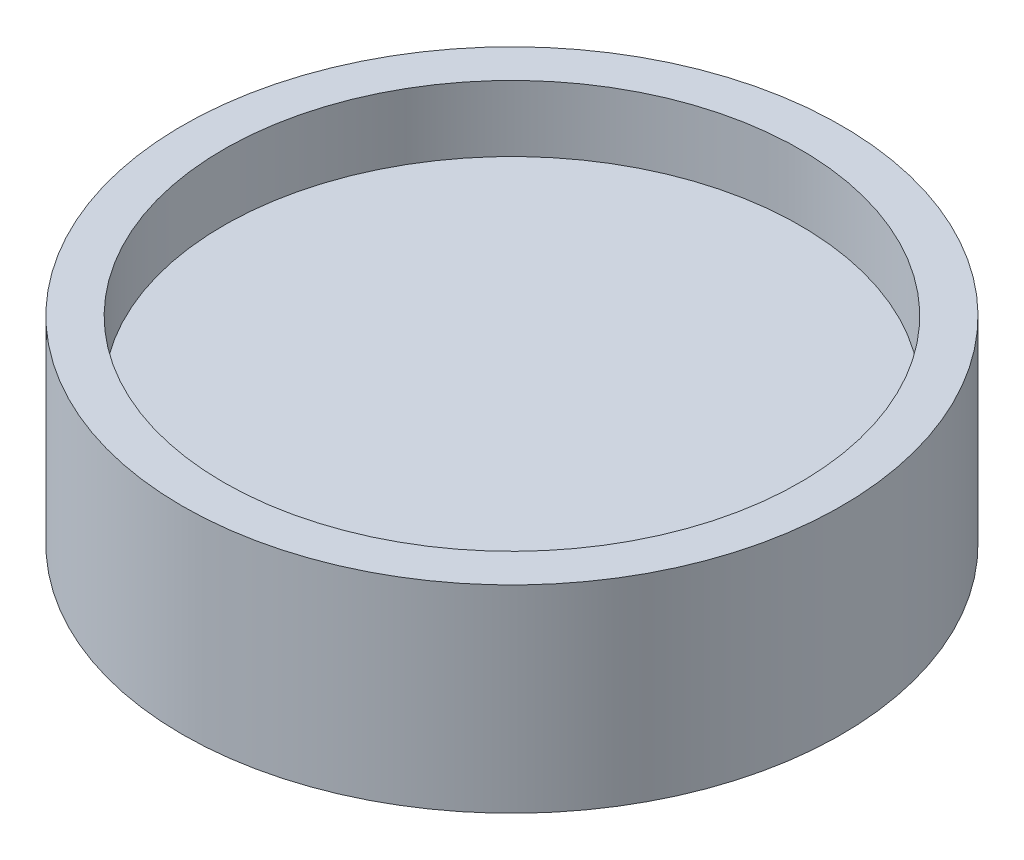
ISO-10303-21;
HEADER;
FILE_DESCRIPTION(('STEP AP214'),'2;1');
FILE_NAME('part.step','',(''),(''),'','','');
FILE_SCHEMA(('AUTOMOTIVE_DESIGN { 1 0 10303 214 1 1 1 1 }'));
ENDSEC;
DATA;
#1=APPLICATION_CONTEXT('core data for automotive mechanical design processes');
#2=APPLICATION_PROTOCOL_DEFINITION('international standard','automotive_design',2000,#1);
#3=PRODUCT_CONTEXT('',#1,'mechanical');
#4=PRODUCT('Part','Part','',(#3));
#5=PRODUCT_RELATED_PRODUCT_CATEGORY('part','',(#4));
#6=PRODUCT_DEFINITION_FORMATION('','',#4);
#7=PRODUCT_DEFINITION_CONTEXT('part definition',#1,'design');
#8=PRODUCT_DEFINITION('design','',#6,#7);
#9=PRODUCT_DEFINITION_SHAPE('','',#8);
#10=(LENGTH_UNIT() NAMED_UNIT(*) SI_UNIT(.MILLI.,.METRE.));
#11=(NAMED_UNIT(*) PLANE_ANGLE_UNIT() SI_UNIT($,.RADIAN.));
#12=(NAMED_UNIT(*) SI_UNIT($,.STERADIAN.) SOLID_ANGLE_UNIT());
#13=UNCERTAINTY_MEASURE_WITH_UNIT(LENGTH_MEASURE(1.E-05),#10,'distance_accuracy_value','');
#14=(GEOMETRIC_REPRESENTATION_CONTEXT(3) GLOBAL_UNCERTAINTY_ASSIGNED_CONTEXT((#13)) GLOBAL_UNIT_ASSIGNED_CONTEXT((#10,
#11,#12)) REPRESENTATION_CONTEXT('',''));
#15=CARTESIAN_POINT('',(0.,0.,0.));
#16=DIRECTION('',(0.,0.,1.));
#17=DIRECTION('',(1.,0.,0.));
#18=AXIS2_PLACEMENT_3D('',#15,#16,#17);
#19=CARTESIAN_POINT('',(0.,24.,0.));
#20=DIRECTION('',(0.,-1.,0.));
#21=DIRECTION('',(0.,0.,-1.));
#22=AXIS2_PLACEMENT_3D('',#19,#20,#21);
#23=CYLINDRICAL_SURFACE('',#22,40.);
#24=CARTESIAN_POINT('',(0.,24.,0.));
#25=DIRECTION('',(0.,1.,0.));
#26=DIRECTION('',(0.,0.,1.));
#27=AXIS2_PLACEMENT_3D('',#24,#25,#26);
#28=CIRCLE('',#27,40.);
#29=CARTESIAN_POINT('',(0.,24.,40.));
#30=VERTEX_POINT('',#29);
#31=EDGE_CURVE('E10',#30,#30,#28,.T.);
#32=ORIENTED_EDGE('',*,*,#31,.F.);
#33=EDGE_LOOP('',(#32));
#34=FACE_BOUND('',#33,.T.);
#35=CARTESIAN_POINT('',(0.,0.,0.));
#36=DIRECTION('',(0.,1.,0.));
#37=DIRECTION('',(0.,0.,1.));
#38=AXIS2_PLACEMENT_3D('',#35,#36,#37);
#39=CIRCLE('',#38,40.);
#40=CARTESIAN_POINT('',(0.,0.,40.));
#41=VERTEX_POINT('',#40);
#42=EDGE_CURVE('E34',#41,#41,#39,.T.);
#43=ORIENTED_EDGE('',*,*,#42,.T.);
#44=EDGE_LOOP('',(#43));
#45=FACE_BOUND('',#44,.T.);
#46=ADVANCED_FACE('F31',(#34,#45),#23,.T.);
#47=CARTESIAN_POINT('',(0.,24.,0.));
#48=DIRECTION('',(0.,1.,0.));
#49=DIRECTION('',(0.,0.,1.));
#50=AXIS2_PLACEMENT_3D('',#47,#48,#49);
#51=PLANE('',#50);
#52=CARTESIAN_POINT('',(0.,24.,0.));
#53=DIRECTION('',(0.,1.,0.));
#54=DIRECTION('',(0.,0.,1.));
#55=AXIS2_PLACEMENT_3D('',#52,#53,#54);
#56=CIRCLE('',#55,35.);
#57=CARTESIAN_POINT('',(0.,24.,35.));
#58=VERTEX_POINT('',#57);
#59=EDGE_CURVE('E43',#58,#58,#56,.T.);
#60=ORIENTED_EDGE('',*,*,#59,.F.);
#61=EDGE_LOOP('',(#60));
#62=FACE_BOUND('',#61,.T.);
#63=ORIENTED_EDGE('',*,*,#31,.T.);
#64=EDGE_LOOP('',(#63));
#65=FACE_BOUND('',#64,.T.);
#66=ADVANCED_FACE('F68',(#62,#65),#51,.T.);
#67=CARTESIAN_POINT('',(0.,0.,0.));
#68=DIRECTION('',(0.,1.,0.));
#69=DIRECTION('',(0.,0.,1.));
#70=AXIS2_PLACEMENT_3D('',#67,#68,#69);
#71=PLANE('',#70);
#72=CARTESIAN_POINT('',(0.,0.,0.));
#73=DIRECTION('',(0.,-1.,0.));
#74=DIRECTION('',(0.,0.,-1.));
#75=AXIS2_PLACEMENT_3D('',#72,#73,#74);
#76=CIRCLE('',#75,35.);
#77=CARTESIAN_POINT('',(0.,0.,-35.));
#78=VERTEX_POINT('',#77);
#79=EDGE_CURVE('E49',#78,#78,#76,.T.);
#80=ORIENTED_EDGE('',*,*,#79,.F.);
#81=EDGE_LOOP('',(#80));
#82=FACE_BOUND('',#81,.T.);
#83=ORIENTED_EDGE('',*,*,#42,.F.);
#84=EDGE_LOOP('',(#83));
#85=FACE_BOUND('',#84,.T.);
#86=ADVANCED_FACE('F64',(#82,#85),#71,.F.);
#87=CARTESIAN_POINT('',(0.,16.,0.));
#88=DIRECTION('',(0.,1.,0.));
#89=DIRECTION('',(0.,0.,1.));
#90=AXIS2_PLACEMENT_3D('',#87,#88,#89);
#91=CYLINDRICAL_SURFACE('',#90,35.);
#92=CARTESIAN_POINT('',(0.,16.,0.));
#93=DIRECTION('',(0.,1.,0.));
#94=DIRECTION('',(0.,0.,1.));
#95=AXIS2_PLACEMENT_3D('',#92,#93,#94);
#96=CIRCLE('',#95,35.);
#97=CARTESIAN_POINT('',(0.,16.,35.));
#98=VERTEX_POINT('',#97);
#99=EDGE_CURVE('E41',#98,#98,#96,.T.);
#100=ORIENTED_EDGE('',*,*,#99,.F.);
#101=EDGE_LOOP('',(#100));
#102=FACE_BOUND('',#101,.T.);
#103=ORIENTED_EDGE('',*,*,#59,.T.);
#104=EDGE_LOOP('',(#103));
#105=FACE_BOUND('',#104,.T.);
#106=ADVANCED_FACE('F67',(#102,#105),#91,.F.);
#107=CARTESIAN_POINT('',(0.,16.,0.));
#108=DIRECTION('',(0.,1.,0.));
#109=DIRECTION('',(0.,0.,1.));
#110=AXIS2_PLACEMENT_3D('',#107,#108,#109);
#111=PLANE('',#110);
#112=ORIENTED_EDGE('',*,*,#99,.T.);
#113=EDGE_LOOP('',(#112));
#114=FACE_BOUND('',#113,.T.);
#115=ADVANCED_FACE('F60',(#114),#111,.T.);
#116=CARTESIAN_POINT('',(0.,8.,0.));
#117=DIRECTION('',(0.,-1.,0.));
#118=DIRECTION('',(0.,0.,-1.));
#119=AXIS2_PLACEMENT_3D('',#116,#117,#118);
#120=CYLINDRICAL_SURFACE('',#119,35.);
#121=CARTESIAN_POINT('',(0.,8.,0.));
#122=DIRECTION('',(0.,-1.,0.));
#123=DIRECTION('',(0.,0.,-1.));
#124=AXIS2_PLACEMENT_3D('',#121,#122,#123);
#125=CIRCLE('',#124,35.);
#126=CARTESIAN_POINT('',(0.,8.,-35.));
#127=VERTEX_POINT('',#126);
#128=EDGE_CURVE('E46',#127,#127,#125,.T.);
#129=ORIENTED_EDGE('',*,*,#128,.F.);
#130=EDGE_LOOP('',(#129));
#131=FACE_BOUND('',#130,.T.);
#132=ORIENTED_EDGE('',*,*,#79,.T.);
#133=EDGE_LOOP('',(#132));
#134=FACE_BOUND('',#133,.T.);
#135=ADVANCED_FACE('F57',(#131,#134),#120,.F.);
#136=CARTESIAN_POINT('',(0.,8.,0.));
#137=DIRECTION('',(0.,-1.,0.));
#138=DIRECTION('',(0.,0.,-1.));
#139=AXIS2_PLACEMENT_3D('',#136,#137,#138);
#140=PLANE('',#139);
#141=ORIENTED_EDGE('',*,*,#128,.T.);
#142=EDGE_LOOP('',(#141));
#143=FACE_BOUND('',#142,.T.);
#144=ADVANCED_FACE('F55',(#143),#140,.T.);
#145=CLOSED_SHELL('',(#46,#66,#86,#106,#115,#135,#144));
#146=MANIFOLD_SOLID_BREP('B2',#145);
#147=ADVANCED_BREP_SHAPE_REPRESENTATION('',(#18,#146),#14);
#148=SHAPE_DEFINITION_REPRESENTATION(#9,#147);
ENDSEC;
END-ISO-10303-21;
